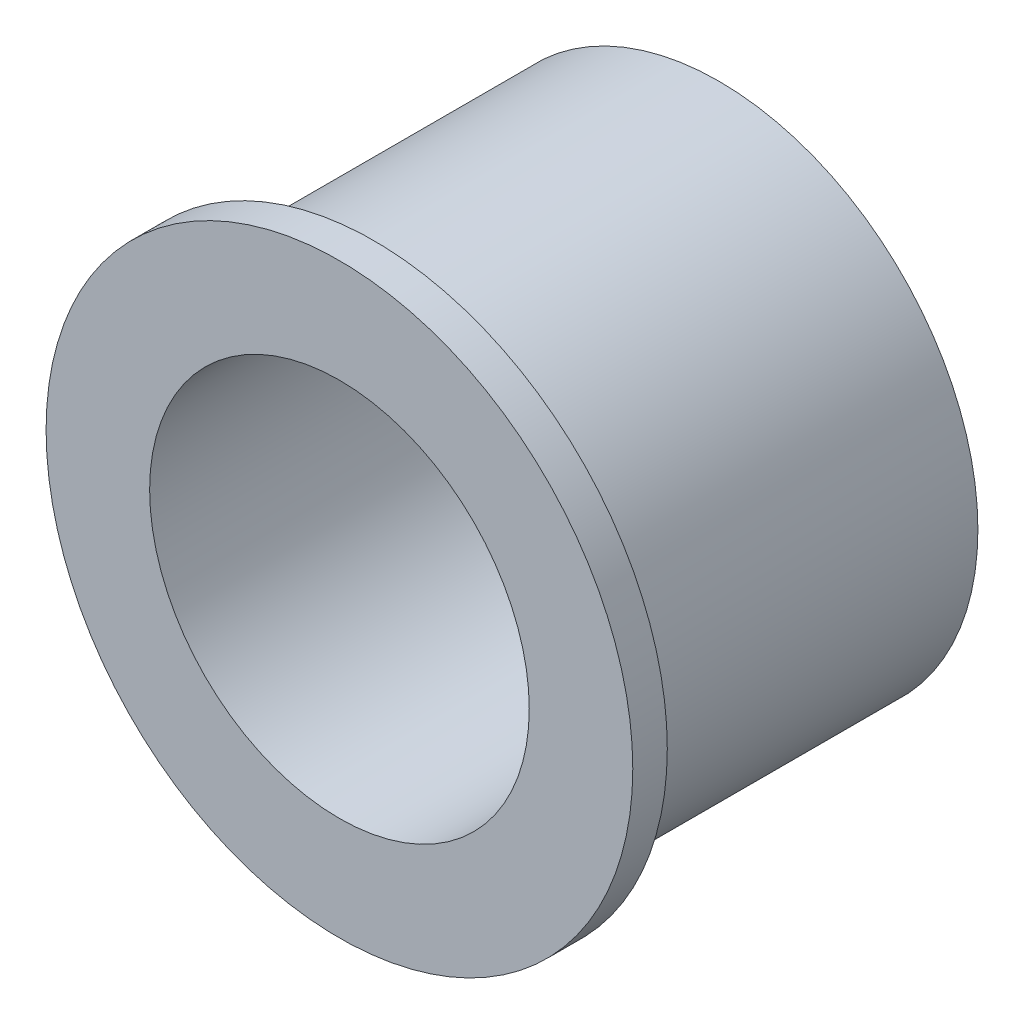
ISO-10303-21;
HEADER;
FILE_DESCRIPTION(('STEP AP214'),'2;1');
FILE_NAME('part.step','',(''),(''),'','','');
FILE_SCHEMA(('AUTOMOTIVE_DESIGN { 1 0 10303 214 1 1 1 1 }'));
ENDSEC;
DATA;
#1=APPLICATION_CONTEXT('core data for automotive mechanical design processes');
#2=APPLICATION_PROTOCOL_DEFINITION('international standard','automotive_design',2000,#1);
#3=PRODUCT_CONTEXT('',#1,'mechanical');
#4=PRODUCT('Part','Part','',(#3));
#5=PRODUCT_RELATED_PRODUCT_CATEGORY('part','',(#4));
#6=PRODUCT_DEFINITION_FORMATION('','',#4);
#7=PRODUCT_DEFINITION_CONTEXT('part definition',#1,'design');
#8=PRODUCT_DEFINITION('design','',#6,#7);
#9=PRODUCT_DEFINITION_SHAPE('','',#8);
#10=(LENGTH_UNIT() NAMED_UNIT(*) SI_UNIT(.MILLI.,.METRE.));
#11=(NAMED_UNIT(*) PLANE_ANGLE_UNIT() SI_UNIT($,.RADIAN.));
#12=(NAMED_UNIT(*) SI_UNIT($,.STERADIAN.) SOLID_ANGLE_UNIT());
#13=UNCERTAINTY_MEASURE_WITH_UNIT(LENGTH_MEASURE(1.E-05),#10,'distance_accuracy_value','');
#14=(GEOMETRIC_REPRESENTATION_CONTEXT(3) GLOBAL_UNCERTAINTY_ASSIGNED_CONTEXT((#13)) GLOBAL_UNIT_ASSIGNED_CONTEXT((#10,
#11,#12)) REPRESENTATION_CONTEXT('',''));
#15=CARTESIAN_POINT('',(0.,0.,0.));
#16=DIRECTION('',(0.,0.,1.));
#17=DIRECTION('',(1.,0.,0.));
#18=AXIS2_PLACEMENT_3D('',#15,#16,#17);
#19=CARTESIAN_POINT('',(0.,0.,0.));
#20=DIRECTION('',(0.,0.,1.));
#21=DIRECTION('',(1.,0.,0.));
#22=AXIS2_PLACEMENT_3D('',#19,#20,#21);
#23=PLANE('',#22);
#24=CARTESIAN_POINT('',(0.,32.5,0.));
#25=DIRECTION('',(0.,0.,-1.));
#26=DIRECTION('',(-1.,0.,0.));
#27=AXIS2_PLACEMENT_3D('',#24,#25,#26);
#28=CIRCLE('',#27,2.);
#29=CARTESIAN_POINT('',(-2.,32.5,0.));
#30=VERTEX_POINT('',#29);
#31=EDGE_CURVE('E140',#30,#30,#28,.T.);
#32=ORIENTED_EDGE('',*,*,#31,.F.);
#33=EDGE_LOOP('',(#32));
#34=FACE_BOUND('',#33,.T.);
#35=CARTESIAN_POINT('',(-22.9809703885632,22.9809703885638,0.));
#36=DIRECTION('',(0.,0.,-1.));
#37=DIRECTION('',(-1.,0.,0.));
#38=AXIS2_PLACEMENT_3D('',#35,#36,#37);
#39=CIRCLE('',#38,2.00000000000016);
#40=CARTESIAN_POINT('',(-24.9809703885634,22.9809703885638,0.));
#41=VERTEX_POINT('',#40);
#42=EDGE_CURVE('E136',#41,#41,#39,.T.);
#43=ORIENTED_EDGE('',*,*,#42,.F.);
#44=EDGE_LOOP('',(#43));
#45=FACE_BOUND('',#44,.T.);
#46=CARTESIAN_POINT('',(-32.5000000000014,1.37958818158635E-12,0.));
#47=DIRECTION('',(0.,0.,-1.));
#48=DIRECTION('',(-1.,0.,0.));
#49=AXIS2_PLACEMENT_3D('',#46,#47,#48);
#50=CIRCLE('',#49,2.00000000000103);
#51=CARTESIAN_POINT('',(-34.5000000000024,1.37958818158635E-12,0.));
#52=VERTEX_POINT('',#51);
#53=EDGE_CURVE('E128',#52,#52,#50,.T.);
#54=ORIENTED_EDGE('',*,*,#53,.F.);
#55=EDGE_LOOP('',(#54));
#56=FACE_BOUND('',#55,.T.);
#57=CARTESIAN_POINT('',(-22.9809703885651,-22.9809703885618,0.));
#58=DIRECTION('',(0.,0.,-1.));
#59=DIRECTION('',(-1.,0.,0.));
#60=AXIS2_PLACEMENT_3D('',#57,#58,#59);
#61=CIRCLE('',#60,2.00000000000213);
#62=CARTESIAN_POINT('',(-24.9809703885673,-22.9809703885618,0.));
#63=VERTEX_POINT('',#62);
#64=EDGE_CURVE('E120',#63,#63,#61,.T.);
#65=ORIENTED_EDGE('',*,*,#64,.F.);
#66=EDGE_LOOP('',(#65));
#67=FACE_BOUND('',#66,.T.);
#68=CARTESIAN_POINT('',(-2.7591763631727E-12,-32.5,0.));
#69=DIRECTION('',(0.,0.,-1.));
#70=DIRECTION('',(-1.,0.,0.));
#71=AXIS2_PLACEMENT_3D('',#68,#69,#70);
#72=CIRCLE('',#71,2.00000000000286);
#73=CARTESIAN_POINT('',(-2.00000000000562,-32.5,0.));
#74=VERTEX_POINT('',#73);
#75=EDGE_CURVE('E112',#74,#74,#72,.T.);
#76=ORIENTED_EDGE('',*,*,#75,.F.);
#77=EDGE_LOOP('',(#76));
#78=FACE_BOUND('',#77,.T.);
#79=CARTESIAN_POINT('',(22.9809703885604,-22.9809703885638,0.));
#80=DIRECTION('',(0.,0.,-1.));
#81=DIRECTION('',(-1.,0.,0.));
#82=AXIS2_PLACEMENT_3D('',#79,#80,#81);
#83=CIRCLE('',#82,2.00000000000281);
#84=CARTESIAN_POINT('',(20.9809703885576,-22.9809703885638,0.));
#85=VERTEX_POINT('',#84);
#86=EDGE_CURVE('E104',#85,#85,#83,.T.);
#87=ORIENTED_EDGE('',*,*,#86,.F.);
#88=EDGE_LOOP('',(#87));
#89=FACE_BOUND('',#88,.T.);
#90=CARTESIAN_POINT('',(32.4999999999986,-1.38356828368358E-12,0.));
#91=DIRECTION('',(0.,0.,-1.));
#92=DIRECTION('',(-1.,0.,0.));
#93=AXIS2_PLACEMENT_3D('',#90,#91,#92);
#94=CIRCLE('',#93,2.00000000000205);
#95=CARTESIAN_POINT('',(30.4999999999966,-1.38356828368358E-12,0.));
#96=VERTEX_POINT('',#95);
#97=EDGE_CURVE('E96',#96,#96,#94,.T.);
#98=ORIENTED_EDGE('',*,*,#97,.F.);
#99=EDGE_LOOP('',(#98));
#100=FACE_BOUND('',#99,.T.);
#101=CARTESIAN_POINT('',(22.9809703885624,22.9809703885618,0.));
#102=DIRECTION('',(0.,0.,-1.));
#103=DIRECTION('',(-1.,0.,0.));
#104=AXIS2_PLACEMENT_3D('',#101,#102,#103);
#105=CIRCLE('',#104,2.00000000000106);
#106=CARTESIAN_POINT('',(20.9809703885613,22.9809703885618,0.));
#107=VERTEX_POINT('',#106);
#108=EDGE_CURVE('E88',#107,#107,#105,.T.);
#109=ORIENTED_EDGE('',*,*,#108,.F.);
#110=EDGE_LOOP('',(#109));
#111=FACE_BOUND('',#110,.T.);
#112=CARTESIAN_POINT('',(0.,0.,0.));
#113=DIRECTION('',(0.,0.,1.));
#114=DIRECTION('',(1.,0.,0.));
#115=AXIS2_PLACEMENT_3D('',#112,#113,#114);
#116=CIRCLE('',#115,37.5);
#117=CARTESIAN_POINT('',(37.5,0.,0.));
#118=VERTEX_POINT('',#117);
#119=EDGE_CURVE('E57',#118,#118,#116,.T.);
#120=ORIENTED_EDGE('',*,*,#119,.F.);
#121=EDGE_LOOP('',(#120));
#122=FACE_BOUND('',#121,.T.);
#123=CARTESIAN_POINT('',(0.,0.,0.));
#124=DIRECTION('',(0.,0.,1.));
#125=DIRECTION('',(1.,0.,0.));
#126=AXIS2_PLACEMENT_3D('',#123,#124,#125);
#127=CIRCLE('',#126,27.5);
#128=CARTESIAN_POINT('',(27.5,0.,0.));
#129=VERTEX_POINT('',#128);
#130=EDGE_CURVE('E66',#129,#129,#127,.T.);
#131=ORIENTED_EDGE('',*,*,#130,.T.);
#132=EDGE_LOOP('',(#131));
#133=FACE_BOUND('',#132,.T.);
#134=ADVANCED_FACE('F53',(#34,#45,#56,#67,#78,#89,#100,#111,#122,#133),#23,.F.);
#135=CARTESIAN_POINT('',(0.,0.,50.));
#136=DIRECTION('',(0.,0.,-1.));
#137=DIRECTION('',(-1.,0.,0.));
#138=AXIS2_PLACEMENT_3D('',#135,#136,#137);
#139=CYLINDRICAL_SURFACE('',#138,37.5);
#140=CARTESIAN_POINT('',(0.,0.,50.));
#141=DIRECTION('',(0.,0.,1.));
#142=DIRECTION('',(1.,0.,0.));
#143=AXIS2_PLACEMENT_3D('',#140,#141,#142);
#144=CIRCLE('',#143,37.5);
#145=CARTESIAN_POINT('',(37.5,0.,50.));
#146=VERTEX_POINT('',#145);
#147=EDGE_CURVE('E12',#146,#146,#144,.T.);
#148=ORIENTED_EDGE('',*,*,#147,.F.);
#149=EDGE_LOOP('',(#148));
#150=FACE_BOUND('',#149,.T.);
#151=ORIENTED_EDGE('',*,*,#119,.T.);
#152=EDGE_LOOP('',(#151));
#153=FACE_BOUND('',#152,.T.);
#154=ADVANCED_FACE('F55',(#150,#153),#139,.T.);
#155=CARTESIAN_POINT('',(0.,0.,50.));
#156=DIRECTION('',(0.,0.,-1.));
#157=DIRECTION('',(-1.,0.,0.));
#158=AXIS2_PLACEMENT_3D('',#155,#156,#157);
#159=CYLINDRICAL_SURFACE('',#158,27.5);
#160=ORIENTED_EDGE('',*,*,#130,.F.);
#161=EDGE_LOOP('',(#160));
#162=FACE_BOUND('',#161,.T.);
#163=CARTESIAN_POINT('',(0.,0.,55.));
#164=DIRECTION('',(0.,0.,1.));
#165=DIRECTION('',(1.,0.,0.));
#166=AXIS2_PLACEMENT_3D('',#163,#164,#165);
#167=CIRCLE('',#166,27.5);
#168=CARTESIAN_POINT('',(27.5,0.,55.));
#169=VERTEX_POINT('',#168);
#170=EDGE_CURVE('E76',#169,#169,#167,.T.);
#171=ORIENTED_EDGE('',*,*,#170,.T.);
#172=EDGE_LOOP('',(#171));
#173=FACE_BOUND('',#172,.T.);
#174=ADVANCED_FACE('F177',(#162,#173),#159,.F.);
#175=CARTESIAN_POINT('',(0.,0.,55.));
#176=DIRECTION('',(0.,0.,1.));
#177=DIRECTION('',(1.,0.,0.));
#178=AXIS2_PLACEMENT_3D('',#175,#176,#177);
#179=PLANE('',#178);
#180=CARTESIAN_POINT('',(0.,0.,55.));
#181=DIRECTION('',(0.,0.,1.));
#182=DIRECTION('',(1.,0.,0.));
#183=AXIS2_PLACEMENT_3D('',#180,#181,#182);
#184=CIRCLE('',#183,42.5);
#185=CARTESIAN_POINT('',(42.5,0.,55.));
#186=VERTEX_POINT('',#185);
#187=EDGE_CURVE('E71',#186,#186,#184,.T.);
#188=ORIENTED_EDGE('',*,*,#187,.T.);
#189=EDGE_LOOP('',(#188));
#190=FACE_BOUND('',#189,.T.);
#191=ORIENTED_EDGE('',*,*,#170,.F.);
#192=EDGE_LOOP('',(#191));
#193=FACE_BOUND('',#192,.T.);
#194=ADVANCED_FACE('F180',(#190,#193),#179,.T.);
#195=CARTESIAN_POINT('',(0.,0.,50.));
#196=DIRECTION('',(0.,0.,1.));
#197=DIRECTION('',(1.,0.,0.));
#198=AXIS2_PLACEMENT_3D('',#195,#196,#197);
#199=PLANE('',#198);
#200=ORIENTED_EDGE('',*,*,#147,.T.);
#201=EDGE_LOOP('',(#200));
#202=FACE_BOUND('',#201,.T.);
#203=CARTESIAN_POINT('',(0.,0.,50.));
#204=DIRECTION('',(0.,0.,1.));
#205=DIRECTION('',(1.,0.,0.));
#206=AXIS2_PLACEMENT_3D('',#203,#204,#205);
#207=CIRCLE('',#206,42.5);
#208=CARTESIAN_POINT('',(42.5,0.,50.));
#209=VERTEX_POINT('',#208);
#210=EDGE_CURVE('E72',#209,#209,#207,.T.);
#211=ORIENTED_EDGE('',*,*,#210,.F.);
#212=EDGE_LOOP('',(#211));
#213=FACE_BOUND('',#212,.T.);
#214=ADVANCED_FACE('F185',(#202,#213),#199,.F.);
#215=CARTESIAN_POINT('',(0.,0.,55.));
#216=DIRECTION('',(0.,0.,-1.));
#217=DIRECTION('',(-1.,0.,0.));
#218=AXIS2_PLACEMENT_3D('',#215,#216,#217);
#219=CYLINDRICAL_SURFACE('',#218,42.5);
#220=ORIENTED_EDGE('',*,*,#187,.F.);
#221=EDGE_LOOP('',(#220));
#222=FACE_BOUND('',#221,.T.);
#223=ORIENTED_EDGE('',*,*,#210,.T.);
#224=EDGE_LOOP('',(#223));
#225=FACE_BOUND('',#224,.T.);
#226=ADVANCED_FACE('F191',(#222,#225),#219,.T.);
#227=CARTESIAN_POINT('',(22.9809703885624,22.9809703885618,10.));
#228=DIRECTION('',(0.,0.,-1.));
#229=DIRECTION('',(-1.,0.,0.));
#230=AXIS2_PLACEMENT_3D('',#227,#228,#229);
#231=CYLINDRICAL_SURFACE('',#230,2.00000000000106);
#232=CARTESIAN_POINT('',(22.9809703885624,22.9809703885618,10.));
#233=DIRECTION('',(0.,0.,-1.));
#234=DIRECTION('',(-1.,0.,0.));
#235=AXIS2_PLACEMENT_3D('',#232,#233,#234);
#236=CIRCLE('',#235,2.00000000000106);
#237=CARTESIAN_POINT('',(20.9809703885613,22.9809703885618,10.));
#238=VERTEX_POINT('',#237);
#239=EDGE_CURVE('E84',#238,#238,#236,.T.);
#240=ORIENTED_EDGE('',*,*,#239,.F.);
#241=EDGE_LOOP('',(#240));
#242=FACE_BOUND('',#241,.T.);
#243=ORIENTED_EDGE('',*,*,#108,.T.);
#244=EDGE_LOOP('',(#243));
#245=FACE_BOUND('',#244,.T.);
#246=ADVANCED_FACE('F198',(#242,#245),#231,.F.);
#247=CARTESIAN_POINT('',(22.9809703885624,22.9809703885618,10.));
#248=DIRECTION('',(0.,0.,-1.));
#249=DIRECTION('',(-1.,0.,0.));
#250=AXIS2_PLACEMENT_3D('',#247,#248,#249);
#251=PLANE('',#250);
#252=ORIENTED_EDGE('',*,*,#239,.T.);
#253=EDGE_LOOP('',(#252));
#254=FACE_BOUND('',#253,.T.);
#255=ADVANCED_FACE('F194',(#254),#251,.T.);
#256=CARTESIAN_POINT('',(32.4999999999986,-1.38356828368358E-12,10.));
#257=DIRECTION('',(0.,0.,-1.));
#258=DIRECTION('',(-1.,0.,0.));
#259=AXIS2_PLACEMENT_3D('',#256,#257,#258);
#260=CYLINDRICAL_SURFACE('',#259,2.00000000000205);
#261=CARTESIAN_POINT('',(32.4999999999986,-1.38356828368358E-12,10.));
#262=DIRECTION('',(0.,0.,-1.));
#263=DIRECTION('',(-1.,0.,0.));
#264=AXIS2_PLACEMENT_3D('',#261,#262,#263);
#265=CIRCLE('',#264,2.00000000000205);
#266=CARTESIAN_POINT('',(30.4999999999966,-1.38356828368358E-12,10.));
#267=VERTEX_POINT('',#266);
#268=EDGE_CURVE('E92',#267,#267,#265,.T.);
#269=ORIENTED_EDGE('',*,*,#268,.F.);
#270=EDGE_LOOP('',(#269));
#271=FACE_BOUND('',#270,.T.);
#272=ORIENTED_EDGE('',*,*,#97,.T.);
#273=EDGE_LOOP('',(#272));
#274=FACE_BOUND('',#273,.T.);
#275=ADVANCED_FACE('F211',(#271,#274),#260,.F.);
#276=CARTESIAN_POINT('',(32.4999999999986,-1.38356828368358E-12,10.));
#277=DIRECTION('',(0.,0.,-1.));
#278=DIRECTION('',(-1.,0.,0.));
#279=AXIS2_PLACEMENT_3D('',#276,#277,#278);
#280=PLANE('',#279);
#281=ORIENTED_EDGE('',*,*,#268,.T.);
#282=EDGE_LOOP('',(#281));
#283=FACE_BOUND('',#282,.T.);
#284=ADVANCED_FACE('F216',(#283),#280,.T.);
#285=CARTESIAN_POINT('',(22.9809703885604,-22.9809703885638,10.));
#286=DIRECTION('',(0.,0.,-1.));
#287=DIRECTION('',(-1.,0.,0.));
#288=AXIS2_PLACEMENT_3D('',#285,#286,#287);
#289=CYLINDRICAL_SURFACE('',#288,2.00000000000281);
#290=CARTESIAN_POINT('',(22.9809703885604,-22.9809703885638,10.));
#291=DIRECTION('',(0.,0.,-1.));
#292=DIRECTION('',(-1.,0.,0.));
#293=AXIS2_PLACEMENT_3D('',#290,#291,#292);
#294=CIRCLE('',#293,2.00000000000281);
#295=CARTESIAN_POINT('',(20.9809703885576,-22.9809703885638,10.));
#296=VERTEX_POINT('',#295);
#297=EDGE_CURVE('E100',#296,#296,#294,.T.);
#298=ORIENTED_EDGE('',*,*,#297,.F.);
#299=EDGE_LOOP('',(#298));
#300=FACE_BOUND('',#299,.T.);
#301=ORIENTED_EDGE('',*,*,#86,.T.);
#302=EDGE_LOOP('',(#301));
#303=FACE_BOUND('',#302,.T.);
#304=ADVANCED_FACE('F219',(#300,#303),#289,.F.);
#305=CARTESIAN_POINT('',(22.9809703885604,-22.9809703885638,10.));
#306=DIRECTION('',(0.,0.,-1.));
#307=DIRECTION('',(-1.,0.,0.));
#308=AXIS2_PLACEMENT_3D('',#305,#306,#307);
#309=PLANE('',#308);
#310=ORIENTED_EDGE('',*,*,#297,.T.);
#311=EDGE_LOOP('',(#310));
#312=FACE_BOUND('',#311,.T.);
#313=ADVANCED_FACE('F224',(#312),#309,.T.);
#314=CARTESIAN_POINT('',(-2.7591763631727E-12,-32.5,10.));
#315=DIRECTION('',(0.,0.,-1.));
#316=DIRECTION('',(-1.,0.,0.));
#317=AXIS2_PLACEMENT_3D('',#314,#315,#316);
#318=CYLINDRICAL_SURFACE('',#317,2.00000000000286);
#319=CARTESIAN_POINT('',(-2.7591763631727E-12,-32.5,10.));
#320=DIRECTION('',(0.,0.,-1.));
#321=DIRECTION('',(-1.,0.,0.));
#322=AXIS2_PLACEMENT_3D('',#319,#320,#321);
#323=CIRCLE('',#322,2.00000000000286);
#324=CARTESIAN_POINT('',(-2.00000000000562,-32.5,10.));
#325=VERTEX_POINT('',#324);
#326=EDGE_CURVE('E108',#325,#325,#323,.T.);
#327=ORIENTED_EDGE('',*,*,#326,.F.);
#328=EDGE_LOOP('',(#327));
#329=FACE_BOUND('',#328,.T.);
#330=ORIENTED_EDGE('',*,*,#75,.T.);
#331=EDGE_LOOP('',(#330));
#332=FACE_BOUND('',#331,.T.);
#333=ADVANCED_FACE('F227',(#329,#332),#318,.F.);
#334=CARTESIAN_POINT('',(-2.7591763631727E-12,-32.5,10.));
#335=DIRECTION('',(0.,0.,-1.));
#336=DIRECTION('',(-1.,0.,0.));
#337=AXIS2_PLACEMENT_3D('',#334,#335,#336);
#338=PLANE('',#337);
#339=ORIENTED_EDGE('',*,*,#326,.T.);
#340=EDGE_LOOP('',(#339));
#341=FACE_BOUND('',#340,.T.);
#342=ADVANCED_FACE('F232',(#341),#338,.T.);
#343=CARTESIAN_POINT('',(-22.9809703885651,-22.9809703885618,10.));
#344=DIRECTION('',(0.,0.,-1.));
#345=DIRECTION('',(-1.,0.,0.));
#346=AXIS2_PLACEMENT_3D('',#343,#344,#345);
#347=CYLINDRICAL_SURFACE('',#346,2.00000000000213);
#348=CARTESIAN_POINT('',(-22.9809703885651,-22.9809703885618,10.));
#349=DIRECTION('',(0.,0.,-1.));
#350=DIRECTION('',(-1.,0.,0.));
#351=AXIS2_PLACEMENT_3D('',#348,#349,#350);
#352=CIRCLE('',#351,2.00000000000213);
#353=CARTESIAN_POINT('',(-24.9809703885673,-22.9809703885618,10.));
#354=VERTEX_POINT('',#353);
#355=EDGE_CURVE('E116',#354,#354,#352,.T.);
#356=ORIENTED_EDGE('',*,*,#355,.F.);
#357=EDGE_LOOP('',(#356));
#358=FACE_BOUND('',#357,.T.);
#359=ORIENTED_EDGE('',*,*,#64,.T.);
#360=EDGE_LOOP('',(#359));
#361=FACE_BOUND('',#360,.T.);
#362=ADVANCED_FACE('F235',(#358,#361),#347,.F.);
#363=CARTESIAN_POINT('',(-22.9809703885651,-22.9809703885618,10.));
#364=DIRECTION('',(0.,0.,-1.));
#365=DIRECTION('',(-1.,0.,0.));
#366=AXIS2_PLACEMENT_3D('',#363,#364,#365);
#367=PLANE('',#366);
#368=ORIENTED_EDGE('',*,*,#355,.T.);
#369=EDGE_LOOP('',(#368));
#370=FACE_BOUND('',#369,.T.);
#371=ADVANCED_FACE('F240',(#370),#367,.T.);
#372=CARTESIAN_POINT('',(-32.5000000000014,1.37958818158635E-12,10.));
#373=DIRECTION('',(0.,0.,-1.));
#374=DIRECTION('',(-1.,0.,0.));
#375=AXIS2_PLACEMENT_3D('',#372,#373,#374);
#376=CYLINDRICAL_SURFACE('',#375,2.00000000000103);
#377=CARTESIAN_POINT('',(-32.5000000000014,1.37958818158635E-12,10.));
#378=DIRECTION('',(0.,0.,-1.));
#379=DIRECTION('',(-1.,0.,0.));
#380=AXIS2_PLACEMENT_3D('',#377,#378,#379);
#381=CIRCLE('',#380,2.00000000000103);
#382=CARTESIAN_POINT('',(-34.5000000000024,1.37958818158635E-12,10.));
#383=VERTEX_POINT('',#382);
#384=EDGE_CURVE('E124',#383,#383,#381,.T.);
#385=ORIENTED_EDGE('',*,*,#384,.F.);
#386=EDGE_LOOP('',(#385));
#387=FACE_BOUND('',#386,.T.);
#388=ORIENTED_EDGE('',*,*,#53,.T.);
#389=EDGE_LOOP('',(#388));
#390=FACE_BOUND('',#389,.T.);
#391=ADVANCED_FACE('F243',(#387,#390),#376,.F.);
#392=CARTESIAN_POINT('',(-32.5000000000014,1.37958818158635E-12,10.));
#393=DIRECTION('',(0.,0.,-1.));
#394=DIRECTION('',(-1.,0.,0.));
#395=AXIS2_PLACEMENT_3D('',#392,#393,#394);
#396=PLANE('',#395);
#397=ORIENTED_EDGE('',*,*,#384,.T.);
#398=EDGE_LOOP('',(#397));
#399=FACE_BOUND('',#398,.T.);
#400=ADVANCED_FACE('F248',(#399),#396,.T.);
#401=CARTESIAN_POINT('',(-22.9809703885632,22.9809703885638,10.));
#402=DIRECTION('',(0.,0.,-1.));
#403=DIRECTION('',(-1.,0.,0.));
#404=AXIS2_PLACEMENT_3D('',#401,#402,#403);
#405=CYLINDRICAL_SURFACE('',#404,2.00000000000016);
#406=CARTESIAN_POINT('',(-22.9809703885632,22.9809703885638,10.));
#407=DIRECTION('',(0.,0.,-1.));
#408=DIRECTION('',(-1.,0.,0.));
#409=AXIS2_PLACEMENT_3D('',#406,#407,#408);
#410=CIRCLE('',#409,2.00000000000016);
#411=CARTESIAN_POINT('',(-24.9809703885634,22.9809703885638,10.));
#412=VERTEX_POINT('',#411);
#413=EDGE_CURVE('E132',#412,#412,#410,.T.);
#414=ORIENTED_EDGE('',*,*,#413,.F.);
#415=EDGE_LOOP('',(#414));
#416=FACE_BOUND('',#415,.T.);
#417=ORIENTED_EDGE('',*,*,#42,.T.);
#418=EDGE_LOOP('',(#417));
#419=FACE_BOUND('',#418,.T.);
#420=ADVANCED_FACE('F251',(#416,#419),#405,.F.);
#421=CARTESIAN_POINT('',(-22.9809703885632,22.9809703885638,10.));
#422=DIRECTION('',(0.,0.,-1.));
#423=DIRECTION('',(-1.,0.,0.));
#424=AXIS2_PLACEMENT_3D('',#421,#422,#423);
#425=PLANE('',#424);
#426=ORIENTED_EDGE('',*,*,#413,.T.);
#427=EDGE_LOOP('',(#426));
#428=FACE_BOUND('',#427,.T.);
#429=ADVANCED_FACE('F153',(#428),#425,.T.);
#430=CARTESIAN_POINT('',(0.,32.5,10.));
#431=DIRECTION('',(0.,0.,-1.));
#432=DIRECTION('',(-1.,0.,0.));
#433=AXIS2_PLACEMENT_3D('',#430,#431,#432);
#434=CYLINDRICAL_SURFACE('',#433,2.);
#435=CARTESIAN_POINT('',(0.,32.5,10.));
#436=DIRECTION('',(0.,0.,-1.));
#437=DIRECTION('',(-1.,0.,0.));
#438=AXIS2_PLACEMENT_3D('',#435,#436,#437);
#439=CIRCLE('',#438,2.);
#440=CARTESIAN_POINT('',(-2.,32.5,10.));
#441=VERTEX_POINT('',#440);
#442=EDGE_CURVE('E83',#441,#441,#439,.T.);
#443=ORIENTED_EDGE('',*,*,#442,.F.);
#444=EDGE_LOOP('',(#443));
#445=FACE_BOUND('',#444,.T.);
#446=ORIENTED_EDGE('',*,*,#31,.T.);
#447=EDGE_LOOP('',(#446));
#448=FACE_BOUND('',#447,.T.);
#449=ADVANCED_FACE('F150',(#445,#448),#434,.F.);
#450=CARTESIAN_POINT('',(0.,32.5,10.));
#451=DIRECTION('',(0.,0.,-1.));
#452=DIRECTION('',(-1.,0.,0.));
#453=AXIS2_PLACEMENT_3D('',#450,#451,#452);
#454=PLANE('',#453);
#455=ORIENTED_EDGE('',*,*,#442,.T.);
#456=EDGE_LOOP('',(#455));
#457=FACE_BOUND('',#456,.T.);
#458=ADVANCED_FACE('F148',(#457),#454,.T.);
#459=CLOSED_SHELL('',(#134,#154,#174,#194,#214,#226,#246,#255,#275,#284,#304,#313,#333,#342,
#362,#371,#391,#400,#420,#429,#449,#458));
#460=MANIFOLD_SOLID_BREP('B2',#459);
#461=ADVANCED_BREP_SHAPE_REPRESENTATION('',(#18,#460),#14);
#462=SHAPE_DEFINITION_REPRESENTATION(#9,#461);
ENDSEC;
END-ISO-10303-21;
